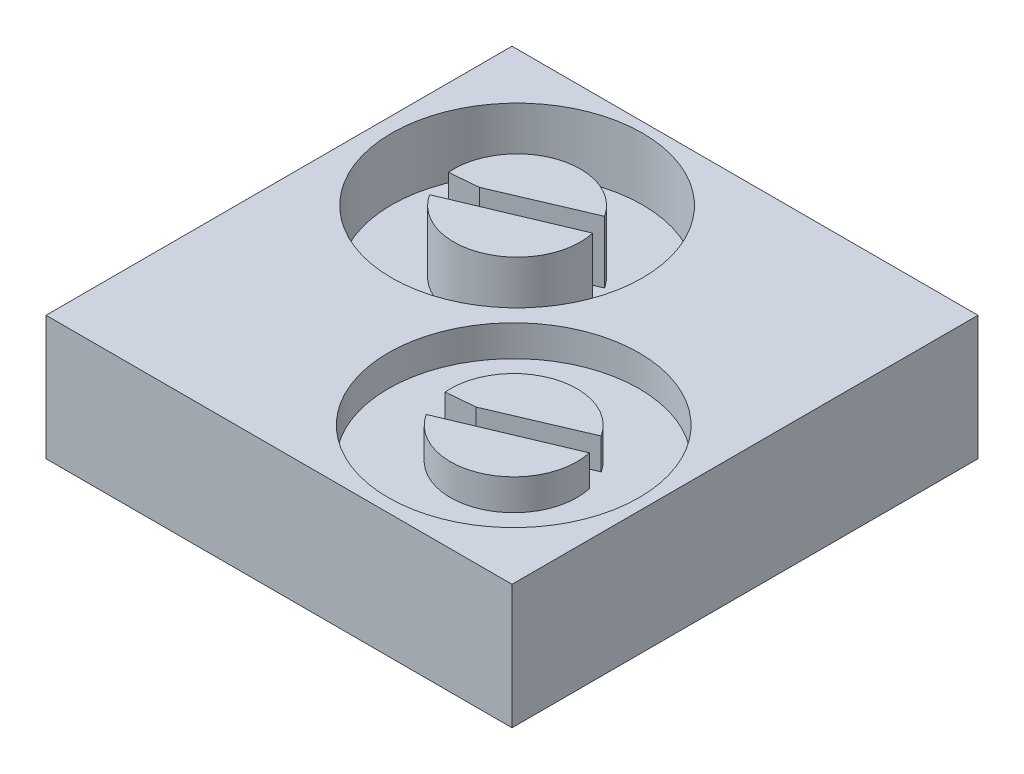
ISO-10303-21;
HEADER;
FILE_DESCRIPTION(('STEP AP214'),'2;1');
FILE_NAME('part.step','',(''),(''),'','','');
FILE_SCHEMA(('AUTOMOTIVE_DESIGN { 1 0 10303 214 1 1 1 1 }'));
ENDSEC;
DATA;
#1=APPLICATION_CONTEXT('core data for automotive mechanical design processes');
#2=APPLICATION_PROTOCOL_DEFINITION('international standard','automotive_design',2000,#1);
#3=PRODUCT_CONTEXT('',#1,'mechanical');
#4=PRODUCT('Part','Part','',(#3));
#5=PRODUCT_RELATED_PRODUCT_CATEGORY('part','',(#4));
#6=PRODUCT_DEFINITION_FORMATION('','',#4);
#7=PRODUCT_DEFINITION_CONTEXT('part definition',#1,'design');
#8=PRODUCT_DEFINITION('design','',#6,#7);
#9=PRODUCT_DEFINITION_SHAPE('','',#8);
#10=(LENGTH_UNIT() NAMED_UNIT(*) SI_UNIT(.MILLI.,.METRE.));
#11=(NAMED_UNIT(*) PLANE_ANGLE_UNIT() SI_UNIT($,.RADIAN.));
#12=(NAMED_UNIT(*) SI_UNIT($,.STERADIAN.) SOLID_ANGLE_UNIT());
#13=UNCERTAINTY_MEASURE_WITH_UNIT(LENGTH_MEASURE(1.E-05),#10,'distance_accuracy_value','');
#14=(GEOMETRIC_REPRESENTATION_CONTEXT(3) GLOBAL_UNCERTAINTY_ASSIGNED_CONTEXT((#13)) GLOBAL_UNIT_ASSIGNED_CONTEXT((#10,
#11,#12)) REPRESENTATION_CONTEXT('',''));
#15=CARTESIAN_POINT('',(0.,0.,0.));
#16=DIRECTION('',(0.,0.,1.));
#17=DIRECTION('',(1.,0.,0.));
#18=AXIS2_PLACEMENT_3D('',#15,#16,#17);
#19=CARTESIAN_POINT('',(-10.592315206773,4.,-10.5377930641485));
#20=DIRECTION('',(1.,0.,0.));
#21=DIRECTION('',(0.,0.,-1.));
#22=AXIS2_PLACEMENT_3D('',#19,#20,#21);
#23=PLANE('',#22);
#24=DIRECTION('',(0.,0.,1.));
#25=VECTOR('',#24,1.);
#26=CARTESIAN_POINT('',(-10.592315206773,0.,-10.5377930641485));
#27=LINE('',#26,#25);
#28=CARTESIAN_POINT('',(-10.592315206773,0.,-10.5377930641485));
#29=VERTEX_POINT('',#28);
#30=CARTESIAN_POINT('',(-10.592315206773,0.,4.46220693585152));
#31=VERTEX_POINT('',#30);
#32=EDGE_CURVE('E306',#29,#31,#27,.T.);
#33=ORIENTED_EDGE('',*,*,#32,.T.);
#34=DIRECTION('',(0.,-1.,0.));
#35=VECTOR('',#34,1.);
#36=CARTESIAN_POINT('',(-10.592315206773,4.,4.46220693585152));
#37=LINE('',#36,#35);
#38=CARTESIAN_POINT('',(-10.592315206773,4.,4.46220693585152));
#39=VERTEX_POINT('',#38);
#40=EDGE_CURVE('E11',#39,#31,#37,.T.);
#41=ORIENTED_EDGE('',*,*,#40,.F.);
#42=DIRECTION('',(0.,0.,1.));
#43=VECTOR('',#42,1.);
#44=CARTESIAN_POINT('',(-10.592315206773,4.,-10.5377930641485));
#45=LINE('',#44,#43);
#46=CARTESIAN_POINT('',(-10.592315206773,4.,-10.5377930641485));
#47=VERTEX_POINT('',#46);
#48=EDGE_CURVE('E310',#47,#39,#45,.T.);
#49=ORIENTED_EDGE('',*,*,#48,.F.);
#50=DIRECTION('',(0.,-1.,0.));
#51=VECTOR('',#50,1.);
#52=CARTESIAN_POINT('',(-10.592315206773,4.,-10.5377930641485));
#53=LINE('',#52,#51);
#54=EDGE_CURVE('E324',#47,#29,#53,.T.);
#55=ORIENTED_EDGE('',*,*,#54,.T.);
#56=EDGE_LOOP('',(#33,#41,#49,#55));
#57=FACE_BOUND('',#56,.T.);
#58=ADVANCED_FACE('F39',(#57),#23,.F.);
#59=CARTESIAN_POINT('',(-10.592315206773,4.,4.46220693585152));
#60=DIRECTION('',(0.,0.,-1.));
#61=DIRECTION('',(-1.,0.,0.));
#62=AXIS2_PLACEMENT_3D('',#59,#60,#61);
#63=PLANE('',#62);
#64=DIRECTION('',(1.,0.,0.));
#65=VECTOR('',#64,1.);
#66=CARTESIAN_POINT('',(-10.592315206773,0.,4.46220693585152));
#67=LINE('',#66,#65);
#68=CARTESIAN_POINT('',(4.40768479322697,0.,4.46220693585152));
#69=VERTEX_POINT('',#68);
#70=EDGE_CURVE('E328',#31,#69,#67,.T.);
#71=ORIENTED_EDGE('',*,*,#70,.T.);
#72=DIRECTION('',(0.,-1.,0.));
#73=VECTOR('',#72,1.);
#74=CARTESIAN_POINT('',(4.40768479322697,4.,4.46220693585152));
#75=LINE('',#74,#73);
#76=CARTESIAN_POINT('',(4.40768479322697,4.,4.46220693585152));
#77=VERTEX_POINT('',#76);
#78=EDGE_CURVE('E47',#77,#69,#75,.T.);
#79=ORIENTED_EDGE('',*,*,#78,.F.);
#80=DIRECTION('',(1.,0.,0.));
#81=VECTOR('',#80,1.);
#82=CARTESIAN_POINT('',(-10.592315206773,4.,4.46220693585152));
#83=LINE('',#82,#81);
#84=EDGE_CURVE('E314',#39,#77,#83,.T.);
#85=ORIENTED_EDGE('',*,*,#84,.F.);
#86=ORIENTED_EDGE('',*,*,#40,.T.);
#87=EDGE_LOOP('',(#71,#79,#85,#86));
#88=FACE_BOUND('',#87,.T.);
#89=ADVANCED_FACE('F364',(#88),#63,.F.);
#90=CARTESIAN_POINT('',(4.40768479322697,4.,-10.5377930641485));
#91=DIRECTION('',(-1.,0.,0.));
#92=DIRECTION('',(0.,0.,1.));
#93=AXIS2_PLACEMENT_3D('',#90,#91,#92);
#94=PLANE('',#93);
#95=DIRECTION('',(0.,0.,-1.));
#96=VECTOR('',#95,1.);
#97=CARTESIAN_POINT('',(4.40768479322697,0.,-10.5377930641485));
#98=LINE('',#97,#96);
#99=CARTESIAN_POINT('',(4.40768479322697,0.,-10.5377930641485));
#100=VERTEX_POINT('',#99);
#101=EDGE_CURVE('E331',#69,#100,#98,.T.);
#102=ORIENTED_EDGE('',*,*,#101,.T.);
#103=DIRECTION('',(0.,-1.,0.));
#104=VECTOR('',#103,1.);
#105=CARTESIAN_POINT('',(4.40768479322697,4.,-10.5377930641485));
#106=LINE('',#105,#104);
#107=CARTESIAN_POINT('',(4.40768479322697,4.,-10.5377930641485));
#108=VERTEX_POINT('',#107);
#109=EDGE_CURVE('E339',#108,#100,#106,.T.);
#110=ORIENTED_EDGE('',*,*,#109,.F.);
#111=DIRECTION('',(0.,0.,-1.));
#112=VECTOR('',#111,1.);
#113=CARTESIAN_POINT('',(4.40768479322697,4.,-10.5377930641485));
#114=LINE('',#113,#112);
#115=EDGE_CURVE('E318',#77,#108,#114,.T.);
#116=ORIENTED_EDGE('',*,*,#115,.F.);
#117=ORIENTED_EDGE('',*,*,#78,.T.);
#118=EDGE_LOOP('',(#102,#110,#116,#117));
#119=FACE_BOUND('',#118,.T.);
#120=ADVANCED_FACE('F348',(#119),#94,.F.);
#121=CARTESIAN_POINT('',(-10.592315206773,4.,-10.5377930641485));
#122=DIRECTION('',(0.,0.,1.));
#123=DIRECTION('',(1.,0.,0.));
#124=AXIS2_PLACEMENT_3D('',#121,#122,#123);
#125=PLANE('',#124);
#126=DIRECTION('',(-1.,0.,0.));
#127=VECTOR('',#126,1.);
#128=CARTESIAN_POINT('',(-10.592315206773,0.,-10.5377930641485));
#129=LINE('',#128,#127);
#130=EDGE_CURVE('E315',#100,#29,#129,.T.);
#131=ORIENTED_EDGE('',*,*,#130,.T.);
#132=ORIENTED_EDGE('',*,*,#54,.F.);
#133=DIRECTION('',(-1.,0.,0.));
#134=VECTOR('',#133,1.);
#135=CARTESIAN_POINT('',(-10.592315206773,4.,-10.5377930641485));
#136=LINE('',#135,#134);
#137=EDGE_CURVE('E321',#108,#47,#136,.T.);
#138=ORIENTED_EDGE('',*,*,#137,.F.);
#139=ORIENTED_EDGE('',*,*,#109,.T.);
#140=EDGE_LOOP('',(#131,#132,#138,#139));
#141=FACE_BOUND('',#140,.T.);
#142=ADVANCED_FACE('F357',(#141),#125,.F.);
#143=CARTESIAN_POINT('',(0.,4.,0.));
#144=DIRECTION('',(0.,1.,0.));
#145=DIRECTION('',(0.,0.,1.));
#146=AXIS2_PLACEMENT_3D('',#143,#144,#145);
#147=PLANE('',#146);
#148=CARTESIAN_POINT('',(-6.07043183703977,4.,-6.17897572268884));
#149=DIRECTION('',(0.,1.,0.));
#150=DIRECTION('',(0.,0.,1.));
#151=AXIS2_PLACEMENT_3D('',#148,#149,#150);
#152=CIRCLE('',#151,4.03739436710594);
#153=CARTESIAN_POINT('',(-6.07043183703977,4.,-2.1415813555829));
#154=VERTEX_POINT('',#153);
#155=EDGE_CURVE('E220',#154,#154,#152,.T.);
#156=ORIENTED_EDGE('',*,*,#155,.F.);
#157=EDGE_LOOP('',(#156));
#158=FACE_BOUND('',#157,.T.);
#159=CARTESIAN_POINT('',(0.,4.,0.));
#160=DIRECTION('',(0.,1.,0.));
#161=DIRECTION('',(0.,0.,1.));
#162=AXIS2_PLACEMENT_3D('',#159,#160,#161);
#163=CIRCLE('',#162,4.03739436710594);
#164=CARTESIAN_POINT('',(0.,4.,4.03739436710594));
#165=VERTEX_POINT('',#164);
#166=EDGE_CURVE('E295',#165,#165,#163,.T.);
#167=ORIENTED_EDGE('',*,*,#166,.F.);
#168=EDGE_LOOP('',(#167));
#169=FACE_BOUND('',#168,.T.);
#170=ORIENTED_EDGE('',*,*,#48,.T.);
#171=ORIENTED_EDGE('',*,*,#84,.T.);
#172=ORIENTED_EDGE('',*,*,#115,.T.);
#173=ORIENTED_EDGE('',*,*,#137,.T.);
#174=EDGE_LOOP('',(#170,#171,#172,#173));
#175=FACE_BOUND('',#174,.T.);
#176=ADVANCED_FACE('F363',(#158,#169,#175),#147,.T.);
#177=CARTESIAN_POINT('',(0.,0.,0.));
#178=DIRECTION('',(0.,1.,0.));
#179=DIRECTION('',(0.,0.,1.));
#180=AXIS2_PLACEMENT_3D('',#177,#178,#179);
#181=PLANE('',#180);
#182=ORIENTED_EDGE('',*,*,#32,.F.);
#183=ORIENTED_EDGE('',*,*,#130,.F.);
#184=ORIENTED_EDGE('',*,*,#101,.F.);
#185=ORIENTED_EDGE('',*,*,#70,.F.);
#186=EDGE_LOOP('',(#182,#183,#184,#185));
#187=FACE_BOUND('',#186,.T.);
#188=ADVANCED_FACE('F354',(#187),#181,.F.);
#189=CARTESIAN_POINT('',(0.,3.,0.));
#190=DIRECTION('',(0.,1.,0.));
#191=DIRECTION('',(0.,0.,1.));
#192=AXIS2_PLACEMENT_3D('',#189,#190,#191);
#193=CYLINDRICAL_SURFACE('',#192,4.03739436710594);
#194=CARTESIAN_POINT('',(0.,3.,0.));
#195=DIRECTION('',(0.,1.,0.));
#196=DIRECTION('',(0.,0.,1.));
#197=AXIS2_PLACEMENT_3D('',#194,#195,#196);
#198=CIRCLE('',#197,4.03739436710594);
#199=CARTESIAN_POINT('',(0.,3.,4.03739436710594));
#200=VERTEX_POINT('',#199);
#201=EDGE_CURVE('E302',#200,#200,#198,.T.);
#202=ORIENTED_EDGE('',*,*,#201,.F.);
#203=EDGE_LOOP('',(#202));
#204=FACE_BOUND('',#203,.T.);
#205=ORIENTED_EDGE('',*,*,#166,.T.);
#206=EDGE_LOOP('',(#205));
#207=FACE_BOUND('',#206,.T.);
#208=ADVANCED_FACE('F376',(#204,#207),#193,.F.);
#209=CARTESIAN_POINT('',(0.,3.,0.));
#210=DIRECTION('',(0.,1.,0.));
#211=DIRECTION('',(0.,0.,1.));
#212=AXIS2_PLACEMENT_3D('',#209,#210,#211);
#213=PLANE('',#212);
#214=DIRECTION('',(-0.922138881823694,0.,0.386858995796851));
#215=VECTOR('',#214,1.);
#216=CARTESIAN_POINT('',(-0.183267540206242,3.,0.467866029233224));
#217=LINE('',#216,#215);
#218=CARTESIAN_POINT('',(-0.183267540206242,3.,0.467866029233224));
#219=VERTEX_POINT('',#218);
#220=CARTESIAN_POINT('',(-1.70963214344853,3.,1.10821195680367));
#221=VERTEX_POINT('',#220);
#222=EDGE_CURVE('E243',#219,#221,#217,.T.);
#223=ORIENTED_EDGE('',*,*,#222,.F.);
#224=DIRECTION('',(-0.921571689021343,0.,0.388208219895392));
#225=VECTOR('',#224,1.);
#226=CARTESIAN_POINT('',(1.98782242865845,3.,-0.446696540435934));
#227=LINE('',#226,#225);
#228=CARTESIAN_POINT('',(1.98782242865845,3.,-0.446696540435934));
#229=VERTEX_POINT('',#228);
#230=EDGE_CURVE('E238',#229,#219,#227,.T.);
#231=ORIENTED_EDGE('',*,*,#230,.F.);
#232=CARTESIAN_POINT('',(0.,3.,0.));
#233=DIRECTION('',(0.,1.,0.));
#234=DIRECTION('',(0.,0.,1.));
#235=AXIS2_PLACEMENT_3D('',#232,#233,#234);
#236=CIRCLE('',#235,2.03739436710594);
#237=EDGE_CURVE('E234',#221,#229,#236,.T.);
#238=ORIENTED_EDGE('',*,*,#237,.F.);
#239=EDGE_LOOP('',(#223,#231,#238));
#240=FACE_BOUND('',#239,.T.);
#241=DIRECTION('',(0.919530227255479,0.,-0.393019288538728));
#242=VECTOR('',#241,1.);
#243=CARTESIAN_POINT('',(-1.10942301800635,3.,0.0979571090786715));
#244=LINE('',#243,#242);
#245=CARTESIAN_POINT('',(-1.10942301800635,3.,0.0979571090786715));
#246=VERTEX_POINT('',#245);
#247=CARTESIAN_POINT('',(1.71027538581445,3.,-1.10721899902064));
#248=VERTEX_POINT('',#247);
#249=EDGE_CURVE('E277',#246,#248,#244,.T.);
#250=ORIENTED_EDGE('',*,*,#249,.F.);
#251=DIRECTION('',(0.996124593577399,0.,-0.08795336304123));
#252=VECTOR('',#251,1.);
#253=CARTESIAN_POINT('',(-2.02949863589029,3.,0.179195686428225));
#254=LINE('',#253,#252);
#255=CARTESIAN_POINT('',(-2.02949863589029,3.,0.179195686428225));
#256=VERTEX_POINT('',#255);
#257=EDGE_CURVE('E272',#256,#246,#254,.T.);
#258=ORIENTED_EDGE('',*,*,#257,.F.);
#259=CARTESIAN_POINT('',(0.,3.,0.));
#260=DIRECTION('',(0.,1.,0.));
#261=DIRECTION('',(0.,0.,1.));
#262=AXIS2_PLACEMENT_3D('',#259,#260,#261);
#263=CIRCLE('',#262,2.03739436710594);
#264=EDGE_CURVE('E268',#248,#256,#263,.T.);
#265=ORIENTED_EDGE('',*,*,#264,.F.);
#266=EDGE_LOOP('',(#250,#258,#265));
#267=FACE_BOUND('',#266,.T.);
#268=ORIENTED_EDGE('',*,*,#201,.T.);
#269=EDGE_LOOP('',(#268));
#270=FACE_BOUND('',#269,.T.);
#271=ADVANCED_FACE('F384',(#240,#267,#270),#213,.T.);
#272=CARTESIAN_POINT('',(0.,3.,0.));
#273=DIRECTION('',(0.,1.,0.));
#274=DIRECTION('',(0.,0.,1.));
#275=AXIS2_PLACEMENT_3D('',#272,#273,#274);
#276=CYLINDRICAL_SURFACE('',#275,2.03739436710594);
#277=CARTESIAN_POINT('',(0.,4.,0.));
#278=DIRECTION('',(0.,1.,0.));
#279=DIRECTION('',(0.,0.,1.));
#280=AXIS2_PLACEMENT_3D('',#277,#278,#279);
#281=CIRCLE('',#280,2.03739436710594);
#282=CARTESIAN_POINT('',(1.71027538581445,4.,-1.10721899902064));
#283=VERTEX_POINT('',#282);
#284=CARTESIAN_POINT('',(-2.02949863589029,4.,0.179195686428225));
#285=VERTEX_POINT('',#284);
#286=EDGE_CURVE('E261',#283,#285,#281,.T.);
#287=ORIENTED_EDGE('',*,*,#286,.F.);
#288=DIRECTION('',(0.,1.,0.));
#289=VECTOR('',#288,1.);
#290=CARTESIAN_POINT('',(1.71027538581445,3.,-1.10721899902064));
#291=LINE('',#290,#289);
#292=EDGE_CURVE('E292',#248,#283,#291,.T.);
#293=ORIENTED_EDGE('',*,*,#292,.F.);
#294=ORIENTED_EDGE('',*,*,#264,.T.);
#295=DIRECTION('',(0.,1.,0.));
#296=VECTOR('',#295,1.);
#297=CARTESIAN_POINT('',(-2.02949863589029,3.,0.179195686428225));
#298=LINE('',#297,#296);
#299=EDGE_CURVE('E281',#256,#285,#298,.T.);
#300=ORIENTED_EDGE('',*,*,#299,.T.);
#301=EDGE_LOOP('',(#287,#293,#294,#300));
#302=FACE_BOUND('',#301,.T.);
#303=ADVANCED_FACE('F388',(#302),#276,.T.);
#304=CARTESIAN_POINT('',(-1.10942301800635,3.,0.0979571090786715));
#305=DIRECTION('',(0.393019288538728,0.,0.919530227255479));
#306=DIRECTION('',(0.919530227255479,0.,-0.393019288538728));
#307=AXIS2_PLACEMENT_3D('',#304,#305,#306);
#308=PLANE('',#307);
#309=DIRECTION('',(0.919530227255479,0.,-0.393019288538728));
#310=VECTOR('',#309,1.);
#311=CARTESIAN_POINT('',(-1.10942301800635,4.,0.0979571090786715));
#312=LINE('',#311,#310);
#313=CARTESIAN_POINT('',(-1.10942301800635,4.,0.0979571090786724));
#314=VERTEX_POINT('',#313);
#315=EDGE_CURVE('E273',#314,#283,#312,.T.);
#316=ORIENTED_EDGE('',*,*,#315,.F.);
#317=DIRECTION('',(0.,1.,0.));
#318=VECTOR('',#317,1.);
#319=CARTESIAN_POINT('',(-1.10942301800635,3.,0.0979571090786715));
#320=LINE('',#319,#318);
#321=EDGE_CURVE('E296',#246,#314,#320,.T.);
#322=ORIENTED_EDGE('',*,*,#321,.F.);
#323=ORIENTED_EDGE('',*,*,#249,.T.);
#324=ORIENTED_EDGE('',*,*,#292,.T.);
#325=EDGE_LOOP('',(#316,#322,#323,#324));
#326=FACE_BOUND('',#325,.T.);
#327=ADVANCED_FACE('F392',(#326),#308,.T.);
#328=CARTESIAN_POINT('',(-2.02949863589029,3.,0.179195686428225));
#329=DIRECTION('',(0.08795336304123,0.,0.996124593577399));
#330=DIRECTION('',(0.996124593577399,0.,-0.0879533630412299));
#331=AXIS2_PLACEMENT_3D('',#328,#329,#330);
#332=PLANE('',#331);
#333=DIRECTION('',(0.996124593577399,0.,-0.08795336304123));
#334=VECTOR('',#333,1.);
#335=CARTESIAN_POINT('',(-2.02949863589029,4.,0.179195686428225));
#336=LINE('',#335,#334);
#337=EDGE_CURVE('E285',#285,#314,#336,.T.);
#338=ORIENTED_EDGE('',*,*,#337,.F.);
#339=ORIENTED_EDGE('',*,*,#299,.F.);
#340=ORIENTED_EDGE('',*,*,#257,.T.);
#341=ORIENTED_EDGE('',*,*,#321,.T.);
#342=EDGE_LOOP('',(#338,#339,#340,#341));
#343=FACE_BOUND('',#342,.T.);
#344=ADVANCED_FACE('F394',(#343),#332,.T.);
#345=CARTESIAN_POINT('',(0.,3.,0.));
#346=DIRECTION('',(0.,1.,0.));
#347=DIRECTION('',(0.,0.,1.));
#348=AXIS2_PLACEMENT_3D('',#345,#346,#347);
#349=CYLINDRICAL_SURFACE('',#348,2.03739436710594);
#350=CARTESIAN_POINT('',(0.,4.,0.));
#351=DIRECTION('',(0.,1.,0.));
#352=DIRECTION('',(0.,0.,1.));
#353=AXIS2_PLACEMENT_3D('',#350,#351,#352);
#354=CIRCLE('',#353,2.03739436710594);
#355=CARTESIAN_POINT('',(-1.70963214344853,4.,1.10821195680367));
#356=VERTEX_POINT('',#355);
#357=CARTESIAN_POINT('',(1.98782242865845,4.,-0.446696540435934));
#358=VERTEX_POINT('',#357);
#359=EDGE_CURVE('E230',#356,#358,#354,.T.);
#360=ORIENTED_EDGE('',*,*,#359,.F.);
#361=DIRECTION('',(0.,1.,0.));
#362=VECTOR('',#361,1.);
#363=CARTESIAN_POINT('',(-1.70963214344853,3.,1.10821195680367));
#364=LINE('',#363,#362);
#365=EDGE_CURVE('E258',#221,#356,#364,.T.);
#366=ORIENTED_EDGE('',*,*,#365,.F.);
#367=ORIENTED_EDGE('',*,*,#237,.T.);
#368=DIRECTION('',(0.,1.,0.));
#369=VECTOR('',#368,1.);
#370=CARTESIAN_POINT('',(1.98782242865845,3.,-0.446696540435934));
#371=LINE('',#370,#369);
#372=EDGE_CURVE('E247',#229,#358,#371,.T.);
#373=ORIENTED_EDGE('',*,*,#372,.T.);
#374=EDGE_LOOP('',(#360,#366,#367,#373));
#375=FACE_BOUND('',#374,.T.);
#376=ADVANCED_FACE('F397',(#375),#349,.T.);
#377=CARTESIAN_POINT('',(-0.183267540206242,3.,0.467866029233224));
#378=DIRECTION('',(-0.386858995796851,0.,-0.922138881823694));
#379=DIRECTION('',(-0.922138881823694,0.,0.386858995796851));
#380=AXIS2_PLACEMENT_3D('',#377,#378,#379);
#381=PLANE('',#380);
#382=DIRECTION('',(-0.922138881823694,0.,0.386858995796851));
#383=VECTOR('',#382,1.);
#384=CARTESIAN_POINT('',(-0.183267540206242,4.,0.467866029233224));
#385=LINE('',#384,#383);
#386=CARTESIAN_POINT('',(-0.183267540206242,4.,0.467866029233224));
#387=VERTEX_POINT('',#386);
#388=EDGE_CURVE('E239',#387,#356,#385,.T.);
#389=ORIENTED_EDGE('',*,*,#388,.F.);
#390=DIRECTION('',(0.,1.,0.));
#391=VECTOR('',#390,1.);
#392=CARTESIAN_POINT('',(-0.183267540206242,3.,0.467866029233224));
#393=LINE('',#392,#391);
#394=EDGE_CURVE('E262',#219,#387,#393,.T.);
#395=ORIENTED_EDGE('',*,*,#394,.F.);
#396=ORIENTED_EDGE('',*,*,#222,.T.);
#397=ORIENTED_EDGE('',*,*,#365,.T.);
#398=EDGE_LOOP('',(#389,#395,#396,#397));
#399=FACE_BOUND('',#398,.T.);
#400=ADVANCED_FACE('F404',(#399),#381,.T.);
#401=CARTESIAN_POINT('',(1.98782242865845,3.,-0.446696540435934));
#402=DIRECTION('',(-0.388208219895392,0.,-0.921571689021343));
#403=DIRECTION('',(-0.921571689021343,0.,0.388208219895392));
#404=AXIS2_PLACEMENT_3D('',#401,#402,#403);
#405=PLANE('',#404);
#406=DIRECTION('',(-0.921571689021343,0.,0.388208219895392));
#407=VECTOR('',#406,1.);
#408=CARTESIAN_POINT('',(1.98782242865845,4.,-0.446696540435934));
#409=LINE('',#408,#407);
#410=EDGE_CURVE('E251',#358,#387,#409,.T.);
#411=ORIENTED_EDGE('',*,*,#410,.F.);
#412=ORIENTED_EDGE('',*,*,#372,.F.);
#413=ORIENTED_EDGE('',*,*,#230,.T.);
#414=ORIENTED_EDGE('',*,*,#394,.T.);
#415=EDGE_LOOP('',(#411,#412,#413,#414));
#416=FACE_BOUND('',#415,.T.);
#417=ADVANCED_FACE('F406',(#416),#405,.T.);
#418=ORIENTED_EDGE('',*,*,#315,.T.);
#419=ORIENTED_EDGE('',*,*,#286,.T.);
#420=ORIENTED_EDGE('',*,*,#337,.T.);
#421=EDGE_LOOP('',(#418,#419,#420));
#422=FACE_BOUND('',#421,.T.);
#423=ADVANCED_FACE('F409',(#422),#147,.T.);
#424=ORIENTED_EDGE('',*,*,#388,.T.);
#425=ORIENTED_EDGE('',*,*,#359,.T.);
#426=ORIENTED_EDGE('',*,*,#410,.T.);
#427=EDGE_LOOP('',(#424,#425,#426));
#428=FACE_BOUND('',#427,.T.);
#429=ADVANCED_FACE('F381',(#428),#147,.T.);
#430=CARTESIAN_POINT('',(-6.07043183703977,2.,-6.17897572268884));
#431=DIRECTION('',(0.,1.,0.));
#432=DIRECTION('',(0.,0.,1.));
#433=AXIS2_PLACEMENT_3D('',#430,#431,#432);
#434=CYLINDRICAL_SURFACE('',#433,4.03739436710594);
#435=CARTESIAN_POINT('',(-6.07043183703977,2.,-6.17897572268884));
#436=DIRECTION('',(0.,1.,0.));
#437=DIRECTION('',(0.,0.,1.));
#438=AXIS2_PLACEMENT_3D('',#435,#436,#437);
#439=CIRCLE('',#438,4.03739436710594);
#440=CARTESIAN_POINT('',(-6.07043183703977,2.,-2.1415813555829));
#441=VERTEX_POINT('',#440);
#442=EDGE_CURVE('E226',#441,#441,#439,.T.);
#443=ORIENTED_EDGE('',*,*,#442,.F.);
#444=EDGE_LOOP('',(#443));
#445=FACE_BOUND('',#444,.T.);
#446=ORIENTED_EDGE('',*,*,#155,.T.);
#447=EDGE_LOOP('',(#446));
#448=FACE_BOUND('',#447,.T.);
#449=ADVANCED_FACE('F414',(#445,#448),#434,.F.);
#450=CARTESIAN_POINT('',(-6.07043183703977,2.,-6.17897572268884));
#451=DIRECTION('',(0.,1.,0.));
#452=DIRECTION('',(0.,0.,1.));
#453=AXIS2_PLACEMENT_3D('',#450,#451,#452);
#454=PLANE('',#453);
#455=DIRECTION('',(-0.922138881823694,0.,0.386858995796851));
#456=VECTOR('',#455,1.);
#457=CARTESIAN_POINT('',(-6.25369937724601,2.,-5.71110969345562));
#458=LINE('',#457,#456);
#459=CARTESIAN_POINT('',(-6.25369937724601,2.,-5.71110969345562));
#460=VERTEX_POINT('',#459);
#461=CARTESIAN_POINT('',(-7.78006398048829,2.,-5.07076376588517));
#462=VERTEX_POINT('',#461);
#463=EDGE_CURVE('E166',#460,#462,#458,.T.);
#464=ORIENTED_EDGE('',*,*,#463,.F.);
#465=DIRECTION('',(-0.921571689021343,0.,0.388208219895392));
#466=VECTOR('',#465,1.);
#467=CARTESIAN_POINT('',(-4.08260940838131,2.,-6.62567226312478));
#468=LINE('',#467,#466);
#469=CARTESIAN_POINT('',(-4.08260940838131,2.,-6.62567226312478));
#470=VERTEX_POINT('',#469);
#471=EDGE_CURVE('E157',#470,#460,#468,.T.);
#472=ORIENTED_EDGE('',*,*,#471,.F.);
#473=CARTESIAN_POINT('',(-6.07043183703977,2.,-6.17897572268884));
#474=DIRECTION('',(0.,1.,0.));
#475=DIRECTION('',(0.,0.,1.));
#476=AXIS2_PLACEMENT_3D('',#473,#474,#475);
#477=CIRCLE('',#476,2.03739436710594);
#478=EDGE_CURVE('E172',#462,#470,#477,.T.);
#479=ORIENTED_EDGE('',*,*,#478,.F.);
#480=EDGE_LOOP('',(#464,#472,#479));
#481=FACE_BOUND('',#480,.T.);
#482=DIRECTION('',(0.919530227255479,0.,-0.393019288538728));
#483=VECTOR('',#482,1.);
#484=CARTESIAN_POINT('',(-7.17985485504612,2.,-6.08101861361017));
#485=LINE('',#484,#483);
#486=CARTESIAN_POINT('',(-7.17985485504612,2.,-6.08101861361017));
#487=VERTEX_POINT('',#486);
#488=CARTESIAN_POINT('',(-4.36015645122532,2.,-7.28619472170948));
#489=VERTEX_POINT('',#488);
#490=EDGE_CURVE('E203',#487,#489,#485,.T.);
#491=ORIENTED_EDGE('',*,*,#490,.F.);
#492=DIRECTION('',(0.996124593577399,0.,-0.08795336304123));
#493=VECTOR('',#492,1.);
#494=CARTESIAN_POINT('',(-8.09993047293006,2.,-5.99978003626062));
#495=LINE('',#494,#493);
#496=CARTESIAN_POINT('',(-8.09993047293006,2.,-5.99978003626062));
#497=VERTEX_POINT('',#496);
#498=EDGE_CURVE('E199',#497,#487,#495,.T.);
#499=ORIENTED_EDGE('',*,*,#498,.F.);
#500=CARTESIAN_POINT('',(-6.07043183703977,2.,-6.17897572268884));
#501=DIRECTION('',(0.,1.,0.));
#502=DIRECTION('',(0.,0.,1.));
#503=AXIS2_PLACEMENT_3D('',#500,#501,#502);
#504=CIRCLE('',#503,2.03739436710594);
#505=EDGE_CURVE('E195',#489,#497,#504,.T.);
#506=ORIENTED_EDGE('',*,*,#505,.F.);
#507=EDGE_LOOP('',(#491,#499,#506));
#508=FACE_BOUND('',#507,.T.);
#509=ORIENTED_EDGE('',*,*,#442,.T.);
#510=EDGE_LOOP('',(#509));
#511=FACE_BOUND('',#510,.T.);
#512=ADVANCED_FACE('F170',(#481,#508,#511),#454,.T.);
#513=CARTESIAN_POINT('',(-6.07043183703977,2.,-6.17897572268884));
#514=DIRECTION('',(0.,1.,0.));
#515=DIRECTION('',(0.,0.,1.));
#516=AXIS2_PLACEMENT_3D('',#513,#514,#515);
#517=CYLINDRICAL_SURFACE('',#516,2.03739436710594);
#518=CARTESIAN_POINT('',(-6.07043183703977,4.,-6.17897572268884));
#519=DIRECTION('',(0.,1.,0.));
#520=DIRECTION('',(0.,0.,1.));
#521=AXIS2_PLACEMENT_3D('',#518,#519,#520);
#522=CIRCLE('',#521,2.03739436710594);
#523=CARTESIAN_POINT('',(-4.36015645122532,4.,-7.28619472170948));
#524=VERTEX_POINT('',#523);
#525=CARTESIAN_POINT('',(-8.09993047293006,4.,-5.99978003626062));
#526=VERTEX_POINT('',#525);
#527=EDGE_CURVE('E192',#524,#526,#522,.T.);
#528=ORIENTED_EDGE('',*,*,#527,.F.);
#529=DIRECTION('',(0.,1.,0.));
#530=VECTOR('',#529,1.);
#531=CARTESIAN_POINT('',(-4.36015645122532,2.,-7.28619472170948));
#532=LINE('',#531,#530);
#533=EDGE_CURVE('E217',#489,#524,#532,.T.);
#534=ORIENTED_EDGE('',*,*,#533,.F.);
#535=ORIENTED_EDGE('',*,*,#505,.T.);
#536=DIRECTION('',(0.,1.,0.));
#537=VECTOR('',#536,1.);
#538=CARTESIAN_POINT('',(-8.09993047293006,2.,-5.99978003626062));
#539=LINE('',#538,#537);
#540=EDGE_CURVE('E207',#497,#526,#539,.T.);
#541=ORIENTED_EDGE('',*,*,#540,.T.);
#542=EDGE_LOOP('',(#528,#534,#535,#541));
#543=FACE_BOUND('',#542,.T.);
#544=ADVANCED_FACE('F420',(#543),#517,.T.);
#545=CARTESIAN_POINT('',(-7.17985485504612,2.,-6.08101861361017));
#546=DIRECTION('',(0.393019288538728,0.,0.919530227255479));
#547=DIRECTION('',(0.919530227255479,0.,-0.393019288538728));
#548=AXIS2_PLACEMENT_3D('',#545,#546,#547);
#549=PLANE('',#548);
#550=DIRECTION('',(0.919530227255479,0.,-0.393019288538728));
#551=VECTOR('',#550,1.);
#552=CARTESIAN_POINT('',(-7.17985485504612,4.,-6.08101861361017));
#553=LINE('',#552,#551);
#554=CARTESIAN_POINT('',(-7.17985485504612,4.,-6.08101861361017));
#555=VERTEX_POINT('',#554);
#556=EDGE_CURVE('E54',#555,#524,#553,.T.);
#557=ORIENTED_EDGE('',*,*,#556,.F.);
#558=DIRECTION('',(0.,1.,0.));
#559=VECTOR('',#558,1.);
#560=CARTESIAN_POINT('',(-7.17985485504612,2.,-6.08101861361017));
#561=LINE('',#560,#559);
#562=EDGE_CURVE('E221',#487,#555,#561,.T.);
#563=ORIENTED_EDGE('',*,*,#562,.F.);
#564=ORIENTED_EDGE('',*,*,#490,.T.);
#565=ORIENTED_EDGE('',*,*,#533,.T.);
#566=EDGE_LOOP('',(#557,#563,#564,#565));
#567=FACE_BOUND('',#566,.T.);
#568=ADVANCED_FACE('F423',(#567),#549,.T.);
#569=CARTESIAN_POINT('',(-8.09993047293006,2.,-5.99978003626062));
#570=DIRECTION('',(0.08795336304123,0.,0.996124593577399));
#571=DIRECTION('',(0.996124593577399,0.,-0.0879533630412299));
#572=AXIS2_PLACEMENT_3D('',#569,#570,#571);
#573=PLANE('',#572);
#574=DIRECTION('',(0.996124593577399,0.,-0.08795336304123));
#575=VECTOR('',#574,1.);
#576=CARTESIAN_POINT('',(-8.09993047293006,4.,-5.99978003626062));
#577=LINE('',#576,#575);
#578=EDGE_CURVE('E211',#526,#555,#577,.T.);
#579=ORIENTED_EDGE('',*,*,#578,.F.);
#580=ORIENTED_EDGE('',*,*,#540,.F.);
#581=ORIENTED_EDGE('',*,*,#498,.T.);
#582=ORIENTED_EDGE('',*,*,#562,.T.);
#583=EDGE_LOOP('',(#579,#580,#581,#582));
#584=FACE_BOUND('',#583,.T.);
#585=ADVANCED_FACE('F425',(#584),#573,.T.);
#586=CARTESIAN_POINT('',(-6.07043183703977,2.,-6.17897572268884));
#587=DIRECTION('',(0.,1.,0.));
#588=DIRECTION('',(0.,0.,1.));
#589=AXIS2_PLACEMENT_3D('',#586,#587,#588);
#590=CYLINDRICAL_SURFACE('',#589,2.03739436710594);
#591=CARTESIAN_POINT('',(-6.07043183703977,4.,-6.17897572268884));
#592=DIRECTION('',(0.,1.,0.));
#593=DIRECTION('',(0.,0.,1.));
#594=AXIS2_PLACEMENT_3D('',#591,#592,#593);
#595=CIRCLE('',#594,2.03739436710594);
#596=CARTESIAN_POINT('',(-7.78006398048829,4.,-5.07076376588517));
#597=VERTEX_POINT('',#596);
#598=CARTESIAN_POINT('',(-4.08260940838131,4.,-6.62567226312478));
#599=VERTEX_POINT('',#598);
#600=EDGE_CURVE('E185',#597,#599,#595,.T.);
#601=ORIENTED_EDGE('',*,*,#600,.F.);
#602=DIRECTION('',(0.,1.,0.));
#603=VECTOR('',#602,1.);
#604=CARTESIAN_POINT('',(-7.78006398048829,2.,-5.07076376588517));
#605=LINE('',#604,#603);
#606=EDGE_CURVE('E177',#462,#597,#605,.T.);
#607=ORIENTED_EDGE('',*,*,#606,.F.);
#608=ORIENTED_EDGE('',*,*,#478,.T.);
#609=DIRECTION('',(0.,1.,0.));
#610=VECTOR('',#609,1.);
#611=CARTESIAN_POINT('',(-4.08260940838131,2.,-6.62567226312478));
#612=LINE('',#611,#610);
#613=EDGE_CURVE('E154',#470,#599,#612,.T.);
#614=ORIENTED_EDGE('',*,*,#613,.T.);
#615=EDGE_LOOP('',(#601,#607,#608,#614));
#616=FACE_BOUND('',#615,.T.);
#617=ADVANCED_FACE('F176',(#616),#590,.T.);
#618=CARTESIAN_POINT('',(-6.25369937724601,2.,-5.71110969345562));
#619=DIRECTION('',(-0.386858995796851,0.,-0.922138881823694));
#620=DIRECTION('',(-0.922138881823694,0.,0.386858995796851));
#621=AXIS2_PLACEMENT_3D('',#618,#619,#620);
#622=PLANE('',#621);
#623=DIRECTION('',(-0.922138881823694,0.,0.386858995796851));
#624=VECTOR('',#623,1.);
#625=CARTESIAN_POINT('',(-6.25369937724601,4.,-5.71110969345562));
#626=LINE('',#625,#624);
#627=CARTESIAN_POINT('',(-6.25369937724601,4.,-5.71110969345562));
#628=VERTEX_POINT('',#627);
#629=EDGE_CURVE('E62',#628,#597,#626,.T.);
#630=ORIENTED_EDGE('',*,*,#629,.F.);
#631=DIRECTION('',(0.,1.,0.));
#632=VECTOR('',#631,1.);
#633=CARTESIAN_POINT('',(-6.25369937724601,2.,-5.71110969345562));
#634=LINE('',#633,#632);
#635=EDGE_CURVE('E165',#460,#628,#634,.T.);
#636=ORIENTED_EDGE('',*,*,#635,.F.);
#637=ORIENTED_EDGE('',*,*,#463,.T.);
#638=ORIENTED_EDGE('',*,*,#606,.T.);
#639=EDGE_LOOP('',(#630,#636,#637,#638));
#640=FACE_BOUND('',#639,.T.);
#641=ADVANCED_FACE('F433',(#640),#622,.T.);
#642=CARTESIAN_POINT('',(-4.08260940838131,2.,-6.62567226312478));
#643=DIRECTION('',(-0.388208219895392,0.,-0.921571689021343));
#644=DIRECTION('',(-0.921571689021343,0.,0.388208219895392));
#645=AXIS2_PLACEMENT_3D('',#642,#643,#644);
#646=PLANE('',#645);
#647=DIRECTION('',(-0.921571689021343,0.,0.388208219895392));
#648=VECTOR('',#647,1.);
#649=CARTESIAN_POINT('',(-4.08260940838131,4.,-6.62567226312478));
#650=LINE('',#649,#648);
#651=EDGE_CURVE('E159',#599,#628,#650,.T.);
#652=ORIENTED_EDGE('',*,*,#651,.F.);
#653=ORIENTED_EDGE('',*,*,#613,.F.);
#654=ORIENTED_EDGE('',*,*,#471,.T.);
#655=ORIENTED_EDGE('',*,*,#635,.T.);
#656=EDGE_LOOP('',(#652,#653,#654,#655));
#657=FACE_BOUND('',#656,.T.);
#658=ADVANCED_FACE('F156',(#657),#646,.T.);
#659=ORIENTED_EDGE('',*,*,#556,.T.);
#660=ORIENTED_EDGE('',*,*,#527,.T.);
#661=ORIENTED_EDGE('',*,*,#578,.T.);
#662=EDGE_LOOP('',(#659,#660,#661));
#663=FACE_BOUND('',#662,.T.);
#664=ADVANCED_FACE('F380',(#663),#147,.T.);
#665=ORIENTED_EDGE('',*,*,#629,.T.);
#666=ORIENTED_EDGE('',*,*,#600,.T.);
#667=ORIENTED_EDGE('',*,*,#651,.T.);
#668=EDGE_LOOP('',(#665,#666,#667));
#669=FACE_BOUND('',#668,.T.);
#670=ADVANCED_FACE('F451',(#669),#147,.T.);
#671=CLOSED_SHELL('',(#58,#89,#120,#142,#176,#188,#208,#271,#303,#327,#344,#376,#400,#417,#423,
#429,#449,#512,#544,#568,#585,#617,#641,#658,#664,#670));
#672=MANIFOLD_SOLID_BREP('B2',#671);
#673=ADVANCED_BREP_SHAPE_REPRESENTATION('',(#18,#672),#14);
#674=SHAPE_DEFINITION_REPRESENTATION(#9,#673);
ENDSEC;
END-ISO-10303-21;
